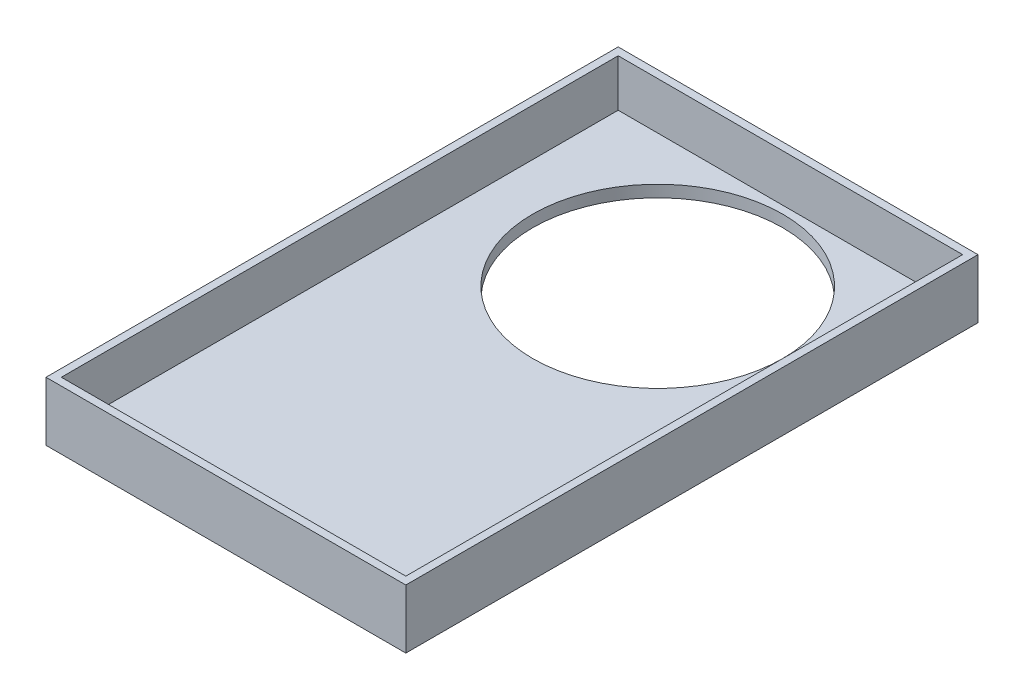
ISO-10303-21;
HEADER;
FILE_DESCRIPTION(('STEP AP214'),'2;1');
FILE_NAME('part.step','',(''),(''),'','','');
FILE_SCHEMA(('AUTOMOTIVE_DESIGN { 1 0 10303 214 1 1 1 1 }'));
ENDSEC;
DATA;
#1=APPLICATION_CONTEXT('core data for automotive mechanical design processes');
#2=APPLICATION_PROTOCOL_DEFINITION('international standard','automotive_design',2000,#1);
#3=PRODUCT_CONTEXT('',#1,'mechanical');
#4=PRODUCT('Part','Part','',(#3));
#5=PRODUCT_RELATED_PRODUCT_CATEGORY('part','',(#4));
#6=PRODUCT_DEFINITION_FORMATION('','',#4);
#7=PRODUCT_DEFINITION_CONTEXT('part definition',#1,'design');
#8=PRODUCT_DEFINITION('design','',#6,#7);
#9=PRODUCT_DEFINITION_SHAPE('','',#8);
#10=(LENGTH_UNIT() NAMED_UNIT(*) SI_UNIT(.MILLI.,.METRE.));
#11=(NAMED_UNIT(*) PLANE_ANGLE_UNIT() SI_UNIT($,.RADIAN.));
#12=(NAMED_UNIT(*) SI_UNIT($,.STERADIAN.) SOLID_ANGLE_UNIT());
#13=UNCERTAINTY_MEASURE_WITH_UNIT(LENGTH_MEASURE(1.E-05),#10,'distance_accuracy_value','');
#14=(GEOMETRIC_REPRESENTATION_CONTEXT(3) GLOBAL_UNCERTAINTY_ASSIGNED_CONTEXT((#13)) GLOBAL_UNIT_ASSIGNED_CONTEXT((#10,
#11,#12)) REPRESENTATION_CONTEXT('',''));
#15=CARTESIAN_POINT('',(0.,0.,0.));
#16=DIRECTION('',(0.,0.,1.));
#17=DIRECTION('',(1.,0.,0.));
#18=AXIS2_PLACEMENT_3D('',#15,#16,#17);
#19=CARTESIAN_POINT('',(0.,35.7,-13.6561426616491));
#20=DIRECTION('',(0.,0.,-1.));
#21=DIRECTION('',(-1.,0.,0.));
#22=AXIS2_PLACEMENT_3D('',#19,#20,#21);
#23=PLANE('',#22);
#24=DIRECTION('',(1.,0.,0.));
#25=VECTOR('',#24,1.);
#26=CARTESIAN_POINT('',(-15.25,5.,-13.6561426616491));
#27=LINE('',#26,#25);
#28=CARTESIAN_POINT('',(-15.25,5.,-13.6561426616491));
#29=VERTEX_POINT('',#28);
#30=CARTESIAN_POINT('',(15.25,5.,-13.6561426616491));
#31=VERTEX_POINT('',#30);
#32=EDGE_CURVE('E109',#29,#31,#27,.T.);
#33=ORIENTED_EDGE('',*,*,#32,.T.);
#34=DIRECTION('',(0.,1.,0.));
#35=VECTOR('',#34,1.);
#36=CARTESIAN_POINT('',(15.25,0.,-13.6561426616491));
#37=LINE('',#36,#35);
#38=CARTESIAN_POINT('',(15.25,0.,-13.6561426616491));
#39=VERTEX_POINT('',#38);
#40=EDGE_CURVE('E184',#39,#31,#37,.T.);
#41=ORIENTED_EDGE('',*,*,#40,.F.);
#42=DIRECTION('',(1.,0.,0.));
#43=VECTOR('',#42,1.);
#44=CARTESIAN_POINT('',(0.,0.,-13.6561426616491));
#45=LINE('',#44,#43);
#46=CARTESIAN_POINT('',(-15.25,0.,-13.6561426616491));
#47=VERTEX_POINT('',#46);
#48=EDGE_CURVE('E130',#47,#39,#45,.T.);
#49=ORIENTED_EDGE('',*,*,#48,.F.);
#50=DIRECTION('',(0.,-1.,0.));
#51=VECTOR('',#50,1.);
#52=CARTESIAN_POINT('',(-15.25,35.7,-13.6561426616491));
#53=LINE('',#52,#51);
#54=EDGE_CURVE('E55',#29,#47,#53,.T.);
#55=ORIENTED_EDGE('',*,*,#54,.F.);
#56=EDGE_LOOP('',(#33,#41,#49,#55));
#57=FACE_BOUND('',#56,.T.);
#58=ADVANCED_FACE('F47',(#57),#23,.T.);
#59=CARTESIAN_POINT('',(-15.25,35.7,0.));
#60=DIRECTION('',(1.,0.,0.));
#61=DIRECTION('',(0.,0.,-1.));
#62=AXIS2_PLACEMENT_3D('',#59,#60,#61);
#63=PLANE('',#62);
#64=DIRECTION('',(0.,-1.,0.));
#65=VECTOR('',#64,1.);
#66=CARTESIAN_POINT('',(-15.25,35.7,34.8438573383509));
#67=LINE('',#66,#65);
#68=CARTESIAN_POINT('',(-15.25,5.,34.8438573383509));
#69=VERTEX_POINT('',#68);
#70=CARTESIAN_POINT('',(-15.25,0.,34.8438573383509));
#71=VERTEX_POINT('',#70);
#72=EDGE_CURVE('E125',#69,#71,#67,.T.);
#73=ORIENTED_EDGE('',*,*,#72,.F.);
#74=DIRECTION('',(0.,0.,1.));
#75=VECTOR('',#74,1.);
#76=CARTESIAN_POINT('',(-15.25,5.,-13.6561426616491));
#77=LINE('',#76,#75);
#78=EDGE_CURVE('E112',#29,#69,#77,.T.);
#79=ORIENTED_EDGE('',*,*,#78,.F.);
#80=ORIENTED_EDGE('',*,*,#54,.T.);
#81=DIRECTION('',(0.,0.,1.));
#82=VECTOR('',#81,1.);
#83=CARTESIAN_POINT('',(-15.25,0.,0.));
#84=LINE('',#83,#82);
#85=EDGE_CURVE('E142',#47,#71,#84,.T.);
#86=ORIENTED_EDGE('',*,*,#85,.T.);
#87=EDGE_LOOP('',(#73,#79,#80,#86));
#88=FACE_BOUND('',#87,.T.);
#89=ADVANCED_FACE('F122',(#88),#63,.F.);
#90=CARTESIAN_POINT('',(0.,35.7,34.8438573383509));
#91=DIRECTION('',(0.,0.,-1.));
#92=DIRECTION('',(-1.,0.,0.));
#93=AXIS2_PLACEMENT_3D('',#90,#91,#92);
#94=PLANE('',#93);
#95=DIRECTION('',(0.,1.,0.));
#96=VECTOR('',#95,1.);
#97=CARTESIAN_POINT('',(15.25,0.,34.8438573383509));
#98=LINE('',#97,#96);
#99=CARTESIAN_POINT('',(15.25,0.,34.8438573383509));
#100=VERTEX_POINT('',#99);
#101=CARTESIAN_POINT('',(15.25,5.,34.8438573383509));
#102=VERTEX_POINT('',#101);
#103=EDGE_CURVE('E180',#100,#102,#98,.T.);
#104=ORIENTED_EDGE('',*,*,#103,.T.);
#105=DIRECTION('',(1.,0.,0.));
#106=VECTOR('',#105,1.);
#107=CARTESIAN_POINT('',(-15.25,5.,34.8438573383509));
#108=LINE('',#107,#106);
#109=EDGE_CURVE('E62',#69,#102,#108,.T.);
#110=ORIENTED_EDGE('',*,*,#109,.F.);
#111=ORIENTED_EDGE('',*,*,#72,.T.);
#112=DIRECTION('',(1.,0.,0.));
#113=VECTOR('',#112,1.);
#114=CARTESIAN_POINT('',(0.,0.,34.8438573383509));
#115=LINE('',#114,#113);
#116=EDGE_CURVE('E138',#71,#100,#115,.T.);
#117=ORIENTED_EDGE('',*,*,#116,.T.);
#118=EDGE_LOOP('',(#104,#110,#111,#117));
#119=FACE_BOUND('',#118,.T.);
#120=ADVANCED_FACE('F207',(#119),#94,.F.);
#121=CARTESIAN_POINT('',(15.25,35.7,0.));
#122=DIRECTION('',(1.,0.,0.));
#123=DIRECTION('',(0.,0.,-1.));
#124=AXIS2_PLACEMENT_3D('',#121,#122,#123);
#125=PLANE('',#124);
#126=DIRECTION('',(0.,0.,1.));
#127=VECTOR('',#126,1.);
#128=CARTESIAN_POINT('',(15.25,5.,-13.6561426616491));
#129=LINE('',#128,#127);
#130=EDGE_CURVE('E113',#31,#102,#129,.T.);
#131=ORIENTED_EDGE('',*,*,#130,.T.);
#132=ORIENTED_EDGE('',*,*,#103,.F.);
#133=DIRECTION('',(0.,0.,1.));
#134=VECTOR('',#133,1.);
#135=CARTESIAN_POINT('',(15.25,0.,0.));
#136=LINE('',#135,#134);
#137=EDGE_CURVE('E133',#39,#100,#136,.T.);
#138=ORIENTED_EDGE('',*,*,#137,.F.);
#139=ORIENTED_EDGE('',*,*,#40,.T.);
#140=EDGE_LOOP('',(#131,#132,#138,#139));
#141=FACE_BOUND('',#140,.T.);
#142=ADVANCED_FACE('F205',(#141),#125,.T.);
#143=CARTESIAN_POINT('',(0.,0.,0.));
#144=DIRECTION('',(0.,1.,0.));
#145=DIRECTION('',(0.,0.,1.));
#146=AXIS2_PLACEMENT_3D('',#143,#144,#145);
#147=PLANE('',#146);
#148=ORIENTED_EDGE('',*,*,#48,.T.);
#149=ORIENTED_EDGE('',*,*,#137,.T.);
#150=ORIENTED_EDGE('',*,*,#116,.F.);
#151=ORIENTED_EDGE('',*,*,#85,.F.);
#152=EDGE_LOOP('',(#148,#149,#150,#151));
#153=FACE_BOUND('',#152,.T.);
#154=CARTESIAN_POINT('',(0.,0.,-1.75614266164913));
#155=DIRECTION('',(0.,1.,0.));
#156=DIRECTION('',(0.,0.,1.));
#157=AXIS2_PLACEMENT_3D('',#154,#155,#156);
#158=CIRCLE('',#157,10.6);
#159=CARTESIAN_POINT('',(0.,0.,8.84385733835087));
#160=VERTEX_POINT('',#159);
#161=EDGE_CURVE('E176',#160,#160,#158,.T.);
#162=ORIENTED_EDGE('',*,*,#161,.T.);
#163=EDGE_LOOP('',(#162));
#164=FACE_BOUND('',#163,.T.);
#165=ADVANCED_FACE('F210',(#153,#164),#147,.F.);
#166=CARTESIAN_POINT('',(-14.6,0.,-13.0061426616491));
#167=DIRECTION('',(-1.,0.,0.));
#168=DIRECTION('',(0.,0.,1.));
#169=AXIS2_PLACEMENT_3D('',#166,#167,#168);
#170=PLANE('',#169);
#171=DIRECTION('',(0.,1.,0.));
#172=VECTOR('',#171,1.);
#173=CARTESIAN_POINT('',(-14.6,0.,-13.0061426616491));
#174=LINE('',#173,#172);
#175=CARTESIAN_POINT('',(-14.6,1.,-13.0061426616491));
#176=VERTEX_POINT('',#175);
#177=CARTESIAN_POINT('',(-14.6,5.,-13.0061426616491));
#178=VERTEX_POINT('',#177);
#179=EDGE_CURVE('E147',#176,#178,#174,.T.);
#180=ORIENTED_EDGE('',*,*,#179,.T.);
#181=DIRECTION('',(0.,0.,1.));
#182=VECTOR('',#181,1.);
#183=CARTESIAN_POINT('',(-14.6,5.,-13.0061426616491));
#184=LINE('',#183,#182);
#185=CARTESIAN_POINT('',(-14.6,5.,34.1938573383509));
#186=VERTEX_POINT('',#185);
#187=EDGE_CURVE('E187',#178,#186,#184,.T.);
#188=ORIENTED_EDGE('',*,*,#187,.T.);
#189=DIRECTION('',(0.,1.,0.));
#190=VECTOR('',#189,1.);
#191=CARTESIAN_POINT('',(-14.6,0.,34.1938573383509));
#192=LINE('',#191,#190);
#193=CARTESIAN_POINT('',(-14.6,1.,34.1938573383509));
#194=VERTEX_POINT('',#193);
#195=EDGE_CURVE('E148',#194,#186,#192,.T.);
#196=ORIENTED_EDGE('',*,*,#195,.F.);
#197=DIRECTION('',(0.,0.,1.));
#198=VECTOR('',#197,1.);
#199=CARTESIAN_POINT('',(-14.6,1.,-13.0061426616491));
#200=LINE('',#199,#198);
#201=EDGE_CURVE('E172',#176,#194,#200,.T.);
#202=ORIENTED_EDGE('',*,*,#201,.F.);
#203=EDGE_LOOP('',(#180,#188,#196,#202));
#204=FACE_BOUND('',#203,.T.);
#205=ADVANCED_FACE('F213',(#204),#170,.F.);
#206=CARTESIAN_POINT('',(-14.6,0.,-13.0061426616491));
#207=DIRECTION('',(0.,0.,-1.));
#208=DIRECTION('',(-1.,0.,0.));
#209=AXIS2_PLACEMENT_3D('',#206,#207,#208);
#210=PLANE('',#209);
#211=DIRECTION('',(0.,1.,0.));
#212=VECTOR('',#211,1.);
#213=CARTESIAN_POINT('',(14.6,0.,-13.0061426616491));
#214=LINE('',#213,#212);
#215=CARTESIAN_POINT('',(14.6,1.,-13.0061426616491));
#216=VERTEX_POINT('',#215);
#217=CARTESIAN_POINT('',(14.6,5.,-13.0061426616491));
#218=VERTEX_POINT('',#217);
#219=EDGE_CURVE('E157',#216,#218,#214,.T.);
#220=ORIENTED_EDGE('',*,*,#219,.T.);
#221=DIRECTION('',(-1.,0.,0.));
#222=VECTOR('',#221,1.);
#223=CARTESIAN_POINT('',(-14.6,5.,-13.0061426616491));
#224=LINE('',#223,#222);
#225=EDGE_CURVE('E194',#218,#178,#224,.T.);
#226=ORIENTED_EDGE('',*,*,#225,.T.);
#227=ORIENTED_EDGE('',*,*,#179,.F.);
#228=DIRECTION('',(-1.,0.,0.));
#229=VECTOR('',#228,1.);
#230=CARTESIAN_POINT('',(-14.6,1.,-13.0061426616491));
#231=LINE('',#230,#229);
#232=EDGE_CURVE('E153',#216,#176,#231,.T.);
#233=ORIENTED_EDGE('',*,*,#232,.F.);
#234=EDGE_LOOP('',(#220,#226,#227,#233));
#235=FACE_BOUND('',#234,.T.);
#236=ADVANCED_FACE('F243',(#235),#210,.F.);
#237=CARTESIAN_POINT('',(14.6,0.,-13.0061426616491));
#238=DIRECTION('',(1.,0.,0.));
#239=DIRECTION('',(0.,0.,-1.));
#240=AXIS2_PLACEMENT_3D('',#237,#238,#239);
#241=PLANE('',#240);
#242=DIRECTION('',(0.,1.,0.));
#243=VECTOR('',#242,1.);
#244=CARTESIAN_POINT('',(14.6,0.,34.1938573383509));
#245=LINE('',#244,#243);
#246=CARTESIAN_POINT('',(14.6,1.,34.1938573383509));
#247=VERTEX_POINT('',#246);
#248=CARTESIAN_POINT('',(14.6,5.,34.1938573383509));
#249=VERTEX_POINT('',#248);
#250=EDGE_CURVE('E152',#247,#249,#245,.T.);
#251=ORIENTED_EDGE('',*,*,#250,.T.);
#252=DIRECTION('',(0.,0.,-1.));
#253=VECTOR('',#252,1.);
#254=CARTESIAN_POINT('',(14.6,5.,-13.0061426616491));
#255=LINE('',#254,#253);
#256=EDGE_CURVE('E70',#249,#218,#255,.T.);
#257=ORIENTED_EDGE('',*,*,#256,.T.);
#258=ORIENTED_EDGE('',*,*,#219,.F.);
#259=DIRECTION('',(0.,0.,-1.));
#260=VECTOR('',#259,1.);
#261=CARTESIAN_POINT('',(14.6,1.,-13.0061426616491));
#262=LINE('',#261,#260);
#263=EDGE_CURVE('E166',#247,#216,#262,.T.);
#264=ORIENTED_EDGE('',*,*,#263,.F.);
#265=EDGE_LOOP('',(#251,#257,#258,#264));
#266=FACE_BOUND('',#265,.T.);
#267=ADVANCED_FACE('F247',(#266),#241,.F.);
#268=CARTESIAN_POINT('',(-14.6,0.,34.1938573383509));
#269=DIRECTION('',(0.,0.,1.));
#270=DIRECTION('',(1.,0.,0.));
#271=AXIS2_PLACEMENT_3D('',#268,#269,#270);
#272=PLANE('',#271);
#273=ORIENTED_EDGE('',*,*,#195,.T.);
#274=DIRECTION('',(1.,0.,0.));
#275=VECTOR('',#274,1.);
#276=CARTESIAN_POINT('',(-14.6,5.,34.1938573383509));
#277=LINE('',#276,#275);
#278=EDGE_CURVE('E11',#186,#249,#277,.T.);
#279=ORIENTED_EDGE('',*,*,#278,.T.);
#280=ORIENTED_EDGE('',*,*,#250,.F.);
#281=DIRECTION('',(1.,0.,0.));
#282=VECTOR('',#281,1.);
#283=CARTESIAN_POINT('',(-14.6,1.,34.1938573383509));
#284=LINE('',#283,#282);
#285=EDGE_CURVE('E169',#194,#247,#284,.T.);
#286=ORIENTED_EDGE('',*,*,#285,.F.);
#287=EDGE_LOOP('',(#273,#279,#280,#286));
#288=FACE_BOUND('',#287,.T.);
#289=ADVANCED_FACE('F227',(#288),#272,.F.);
#290=CARTESIAN_POINT('',(0.,1.,0.));
#291=DIRECTION('',(0.,1.,0.));
#292=DIRECTION('',(0.,0.,1.));
#293=AXIS2_PLACEMENT_3D('',#290,#291,#292);
#294=PLANE('',#293);
#295=ORIENTED_EDGE('',*,*,#201,.T.);
#296=ORIENTED_EDGE('',*,*,#285,.T.);
#297=ORIENTED_EDGE('',*,*,#263,.T.);
#298=ORIENTED_EDGE('',*,*,#232,.T.);
#299=EDGE_LOOP('',(#295,#296,#297,#298));
#300=FACE_BOUND('',#299,.T.);
#301=CARTESIAN_POINT('',(0.,1.,-1.75614266164913));
#302=DIRECTION('',(0.,1.,0.));
#303=DIRECTION('',(0.,0.,1.));
#304=AXIS2_PLACEMENT_3D('',#301,#302,#303);
#305=CIRCLE('',#304,10.6);
#306=CARTESIAN_POINT('',(0.,1.,8.84385733835087));
#307=VERTEX_POINT('',#306);
#308=EDGE_CURVE('E175',#307,#307,#305,.T.);
#309=ORIENTED_EDGE('',*,*,#308,.F.);
#310=EDGE_LOOP('',(#309));
#311=FACE_BOUND('',#310,.T.);
#312=ADVANCED_FACE('F219',(#300,#311),#294,.T.);
#313=CARTESIAN_POINT('',(0.,1.,-1.75614266164913));
#314=DIRECTION('',(0.,-1.,0.));
#315=DIRECTION('',(0.,0.,-1.));
#316=AXIS2_PLACEMENT_3D('',#313,#314,#315);
#317=CYLINDRICAL_SURFACE('',#316,10.6);
#318=ORIENTED_EDGE('',*,*,#308,.T.);
#319=EDGE_LOOP('',(#318));
#320=FACE_BOUND('',#319,.T.);
#321=ORIENTED_EDGE('',*,*,#161,.F.);
#322=EDGE_LOOP('',(#321));
#323=FACE_BOUND('',#322,.T.);
#324=ADVANCED_FACE('F217',(#320,#323),#317,.F.);
#325=CARTESIAN_POINT('',(-15.25,5.,-13.6561426616491));
#326=DIRECTION('',(0.,-1.,0.));
#327=DIRECTION('',(1.,0.,0.));
#328=AXIS2_PLACEMENT_3D('',#325,#326,#327);
#329=PLANE('',#328);
#330=ORIENTED_EDGE('',*,*,#109,.T.);
#331=ORIENTED_EDGE('',*,*,#130,.F.);
#332=ORIENTED_EDGE('',*,*,#32,.F.);
#333=ORIENTED_EDGE('',*,*,#78,.T.);
#334=EDGE_LOOP('',(#330,#331,#332,#333));
#335=FACE_BOUND('',#334,.T.);
#336=ORIENTED_EDGE('',*,*,#225,.F.);
#337=ORIENTED_EDGE('',*,*,#256,.F.);
#338=ORIENTED_EDGE('',*,*,#278,.F.);
#339=ORIENTED_EDGE('',*,*,#187,.F.);
#340=EDGE_LOOP('',(#336,#337,#338,#339));
#341=FACE_BOUND('',#340,.T.);
#342=ADVANCED_FACE('F111',(#335,#341),#329,.F.);
#343=CLOSED_SHELL('',(#58,#89,#120,#142,#165,#205,#236,#267,#289,#312,#324,#342));
#344=MANIFOLD_SOLID_BREP('B2',#343);
#345=ADVANCED_BREP_SHAPE_REPRESENTATION('',(#18,#344),#14);
#346=SHAPE_DEFINITION_REPRESENTATION(#9,#345);
ENDSEC;
END-ISO-10303-21;
